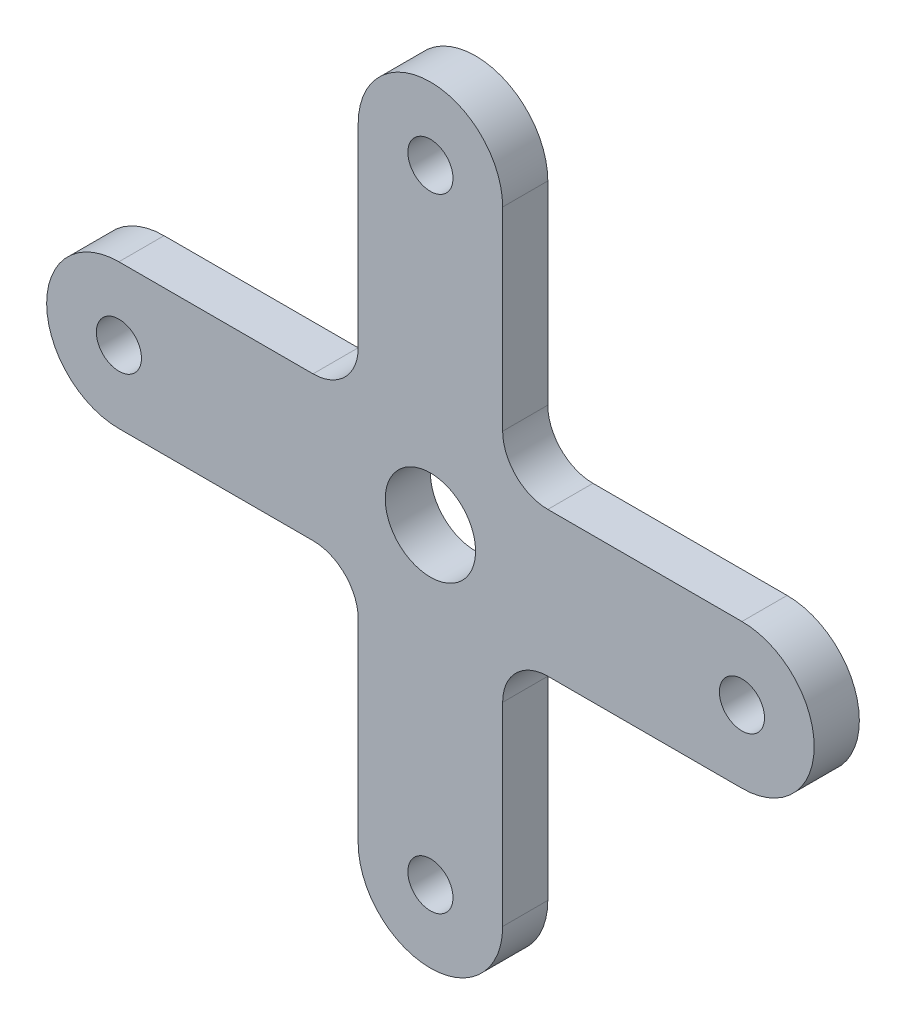
ISO-10303-21;
HEADER;
FILE_DESCRIPTION(('STEP AP214'),'2;1');
FILE_NAME('part.step','',(''),(''),'','','');
FILE_SCHEMA(('AUTOMOTIVE_DESIGN { 1 0 10303 214 1 1 1 1 }'));
ENDSEC;
DATA;
#1=APPLICATION_CONTEXT('core data for automotive mechanical design processes');
#2=APPLICATION_PROTOCOL_DEFINITION('international standard','automotive_design',2000,#1);
#3=PRODUCT_CONTEXT('',#1,'mechanical');
#4=PRODUCT('Part','Part','',(#3));
#5=PRODUCT_RELATED_PRODUCT_CATEGORY('part','',(#4));
#6=PRODUCT_DEFINITION_FORMATION('','',#4);
#7=PRODUCT_DEFINITION_CONTEXT('part definition',#1,'design');
#8=PRODUCT_DEFINITION('design','',#6,#7);
#9=PRODUCT_DEFINITION_SHAPE('','',#8);
#10=(LENGTH_UNIT() NAMED_UNIT(*) SI_UNIT(.MILLI.,.METRE.));
#11=(NAMED_UNIT(*) PLANE_ANGLE_UNIT() SI_UNIT($,.RADIAN.));
#12=(NAMED_UNIT(*) SI_UNIT($,.STERADIAN.) SOLID_ANGLE_UNIT());
#13=UNCERTAINTY_MEASURE_WITH_UNIT(LENGTH_MEASURE(1.E-05),#10,'distance_accuracy_value','');
#14=(GEOMETRIC_REPRESENTATION_CONTEXT(3) GLOBAL_UNCERTAINTY_ASSIGNED_CONTEXT((#13)) GLOBAL_UNIT_ASSIGNED_CONTEXT((#10,
#11,#12)) REPRESENTATION_CONTEXT('',''));
#15=CARTESIAN_POINT('',(0.,0.,0.));
#16=DIRECTION('',(0.,0.,1.));
#17=DIRECTION('',(1.,0.,0.));
#18=AXIS2_PLACEMENT_3D('',#15,#16,#17);
#19=CARTESIAN_POINT('',(-6.9,0.,0.));
#20=DIRECTION('',(0.,0.,1.));
#21=DIRECTION('',(1.,0.,0.));
#22=AXIS2_PLACEMENT_3D('',#19,#20,#21);
#23=PLANE('',#22);
#24=CARTESIAN_POINT('',(0.,-6.9,0.));
#25=DIRECTION('',(0.,0.,-1.));
#26=DIRECTION('',(-1.,0.,0.));
#27=AXIS2_PLACEMENT_3D('',#24,#25,#26);
#28=CIRCLE('',#27,0.500000000000001);
#29=CARTESIAN_POINT('',(-0.500000000000025,-6.9,0.));
#30=VERTEX_POINT('',#29);
#31=EDGE_CURVE('E230',#30,#30,#28,.F.);
#32=ORIENTED_EDGE('',*,*,#31,.T.);
#33=EDGE_LOOP('',(#32));
#34=FACE_BOUND('',#33,.T.);
#35=CARTESIAN_POINT('',(0.,0.,0.));
#36=DIRECTION('',(0.,0.,-1.));
#37=DIRECTION('',(-1.,0.,0.));
#38=AXIS2_PLACEMENT_3D('',#35,#36,#37);
#39=CIRCLE('',#38,1.);
#40=CARTESIAN_POINT('',(-1.,0.,0.));
#41=VERTEX_POINT('',#40);
#42=EDGE_CURVE('E233',#41,#41,#39,.F.);
#43=ORIENTED_EDGE('',*,*,#42,.T.);
#44=EDGE_LOOP('',(#43));
#45=FACE_BOUND('',#44,.T.);
#46=CARTESIAN_POINT('',(-6.9,0.,0.));
#47=DIRECTION('',(0.,0.,-1.));
#48=DIRECTION('',(-1.,0.,0.));
#49=AXIS2_PLACEMENT_3D('',#46,#47,#48);
#50=CIRCLE('',#49,0.5);
#51=CARTESIAN_POINT('',(-7.4,0.,0.));
#52=VERTEX_POINT('',#51);
#53=EDGE_CURVE('E159',#52,#52,#50,.F.);
#54=ORIENTED_EDGE('',*,*,#53,.T.);
#55=EDGE_LOOP('',(#54));
#56=FACE_BOUND('',#55,.T.);
#57=DIRECTION('',(1.,0.,0.));
#58=VECTOR('',#57,1.);
#59=CARTESIAN_POINT('',(-2.59999999999999,1.6,0.));
#60=LINE('',#59,#58);
#61=CARTESIAN_POINT('',(-6.9,1.6,0.));
#62=VERTEX_POINT('',#61);
#63=CARTESIAN_POINT('',(-2.59999999999999,1.6,0.));
#64=VERTEX_POINT('',#63);
#65=EDGE_CURVE('E157',#62,#64,#60,.T.);
#66=ORIENTED_EDGE('',*,*,#65,.T.);
#67=CARTESIAN_POINT('',(-2.59999999999999,2.6,0.));
#68=DIRECTION('',(0.,0.,-1.));
#69=DIRECTION('',(-1.,0.,0.));
#70=AXIS2_PLACEMENT_3D('',#67,#68,#69);
#71=CIRCLE('',#70,1.);
#72=CARTESIAN_POINT('',(-1.59999999999999,2.6,0.));
#73=VERTEX_POINT('',#72);
#74=EDGE_CURVE('E238',#64,#73,#71,.F.);
#75=ORIENTED_EDGE('',*,*,#74,.T.);
#76=DIRECTION('',(0.,1.,0.));
#77=VECTOR('',#76,1.);
#78=CARTESIAN_POINT('',(-1.59999999999998,6.90000000000001,0.));
#79=LINE('',#78,#77);
#80=CARTESIAN_POINT('',(-1.59999999999998,6.90000000000001,0.));
#81=VERTEX_POINT('',#80);
#82=EDGE_CURVE('E160',#73,#81,#79,.T.);
#83=ORIENTED_EDGE('',*,*,#82,.T.);
#84=CARTESIAN_POINT('',(0.,6.9,0.));
#85=DIRECTION('',(0.,0.,-1.));
#86=DIRECTION('',(-1.,0.,0.));
#87=AXIS2_PLACEMENT_3D('',#84,#85,#86);
#88=CIRCLE('',#87,1.6);
#89=CARTESIAN_POINT('',(1.60000000000002,6.9,0.));
#90=VERTEX_POINT('',#89);
#91=EDGE_CURVE('E168',#90,#81,#88,.F.);
#92=ORIENTED_EDGE('',*,*,#91,.F.);
#93=DIRECTION('',(0.,-1.,0.));
#94=VECTOR('',#93,1.);
#95=CARTESIAN_POINT('',(1.60000000000001,2.6,0.));
#96=LINE('',#95,#94);
#97=CARTESIAN_POINT('',(1.60000000000001,2.6,0.));
#98=VERTEX_POINT('',#97);
#99=EDGE_CURVE('E165',#90,#98,#96,.T.);
#100=ORIENTED_EDGE('',*,*,#99,.T.);
#101=CARTESIAN_POINT('',(2.60000000000001,2.6,0.));
#102=DIRECTION('',(0.,0.,-1.));
#103=DIRECTION('',(-1.,0.,0.));
#104=AXIS2_PLACEMENT_3D('',#101,#102,#103);
#105=CIRCLE('',#104,1.);
#106=CARTESIAN_POINT('',(2.60000000000001,1.6,0.));
#107=VERTEX_POINT('',#106);
#108=EDGE_CURVE('E243',#98,#107,#105,.F.);
#109=ORIENTED_EDGE('',*,*,#108,.T.);
#110=DIRECTION('',(1.,0.,0.));
#111=VECTOR('',#110,1.);
#112=CARTESIAN_POINT('',(6.9,1.6,0.));
#113=LINE('',#112,#111);
#114=CARTESIAN_POINT('',(6.9,1.6,0.));
#115=VERTEX_POINT('',#114);
#116=EDGE_CURVE('E170',#107,#115,#113,.T.);
#117=ORIENTED_EDGE('',*,*,#116,.T.);
#118=CARTESIAN_POINT('',(6.9,0.,0.));
#119=DIRECTION('',(0.,0.,-1.));
#120=DIRECTION('',(-1.,0.,0.));
#121=AXIS2_PLACEMENT_3D('',#118,#119,#120);
#122=CIRCLE('',#121,1.6);
#123=CARTESIAN_POINT('',(6.9,-1.6,0.));
#124=VERTEX_POINT('',#123);
#125=EDGE_CURVE('E178',#124,#115,#122,.F.);
#126=ORIENTED_EDGE('',*,*,#125,.F.);
#127=DIRECTION('',(1.,0.,0.));
#128=VECTOR('',#127,1.);
#129=CARTESIAN_POINT('',(2.59999999999999,-1.6,0.));
#130=LINE('',#129,#128);
#131=CARTESIAN_POINT('',(2.59999999999999,-1.6,0.));
#132=VERTEX_POINT('',#131);
#133=EDGE_CURVE('E175',#124,#132,#130,.F.);
#134=ORIENTED_EDGE('',*,*,#133,.T.);
#135=CARTESIAN_POINT('',(2.59999999999999,-2.6,0.));
#136=DIRECTION('',(0.,0.,-1.));
#137=DIRECTION('',(-1.,0.,0.));
#138=AXIS2_PLACEMENT_3D('',#135,#136,#137);
#139=CIRCLE('',#138,1.);
#140=CARTESIAN_POINT('',(1.59999999999999,-2.6,0.));
#141=VERTEX_POINT('',#140);
#142=EDGE_CURVE('E248',#132,#141,#139,.F.);
#143=ORIENTED_EDGE('',*,*,#142,.T.);
#144=DIRECTION('',(0.,-1.,0.));
#145=VECTOR('',#144,1.);
#146=CARTESIAN_POINT('',(1.59999999999998,-6.9,0.));
#147=LINE('',#146,#145);
#148=CARTESIAN_POINT('',(1.59999999999998,-6.9,0.));
#149=VERTEX_POINT('',#148);
#150=EDGE_CURVE('E180',#141,#149,#147,.T.);
#151=ORIENTED_EDGE('',*,*,#150,.T.);
#152=CARTESIAN_POINT('',(0.,-6.9,0.));
#153=DIRECTION('',(0.,0.,-1.));
#154=DIRECTION('',(-1.,0.,0.));
#155=AXIS2_PLACEMENT_3D('',#152,#153,#154);
#156=CIRCLE('',#155,1.6);
#157=CARTESIAN_POINT('',(-1.60000000000002,-6.9,0.));
#158=VERTEX_POINT('',#157);
#159=EDGE_CURVE('E186',#158,#149,#156,.F.);
#160=ORIENTED_EDGE('',*,*,#159,.F.);
#161=DIRECTION('',(0.,1.,0.));
#162=VECTOR('',#161,1.);
#163=CARTESIAN_POINT('',(-1.60000000000001,-2.6,0.));
#164=LINE('',#163,#162);
#165=CARTESIAN_POINT('',(-1.60000000000001,-2.6,0.));
#166=VERTEX_POINT('',#165);
#167=EDGE_CURVE('E185',#158,#166,#164,.T.);
#168=ORIENTED_EDGE('',*,*,#167,.T.);
#169=CARTESIAN_POINT('',(-2.60000000000001,-2.6,0.));
#170=DIRECTION('',(0.,0.,-1.));
#171=DIRECTION('',(-1.,0.,0.));
#172=AXIS2_PLACEMENT_3D('',#169,#170,#171);
#173=CIRCLE('',#172,1.);
#174=CARTESIAN_POINT('',(-2.60000000000001,-1.6,0.));
#175=VERTEX_POINT('',#174);
#176=EDGE_CURVE('E145',#166,#175,#173,.F.);
#177=ORIENTED_EDGE('',*,*,#176,.T.);
#178=DIRECTION('',(1.,0.,0.));
#179=VECTOR('',#178,1.);
#180=CARTESIAN_POINT('',(-6.9,-1.6,0.));
#181=LINE('',#180,#179);
#182=CARTESIAN_POINT('',(-6.9,-1.6,0.));
#183=VERTEX_POINT('',#182);
#184=EDGE_CURVE('E142',#175,#183,#181,.F.);
#185=ORIENTED_EDGE('',*,*,#184,.T.);
#186=CARTESIAN_POINT('',(-6.9,0.,0.));
#187=DIRECTION('',(0.,0.,-1.));
#188=DIRECTION('',(-1.,0.,0.));
#189=AXIS2_PLACEMENT_3D('',#186,#187,#188);
#190=CIRCLE('',#189,1.6);
#191=EDGE_CURVE('E128',#62,#183,#190,.F.);
#192=ORIENTED_EDGE('',*,*,#191,.F.);
#193=EDGE_LOOP('',(#66,#75,#83,#92,#100,#109,#117,#126,#134,#143,#151,#160,#168,#177,#185,#192));
#194=FACE_BOUND('',#193,.T.);
#195=CARTESIAN_POINT('',(6.9,0.,0.));
#196=DIRECTION('',(0.,0.,-1.));
#197=DIRECTION('',(-1.,0.,0.));
#198=AXIS2_PLACEMENT_3D('',#195,#196,#197);
#199=CIRCLE('',#198,0.5);
#200=CARTESIAN_POINT('',(6.4,0.,0.));
#201=VERTEX_POINT('',#200);
#202=EDGE_CURVE('E139',#201,#201,#199,.F.);
#203=ORIENTED_EDGE('',*,*,#202,.T.);
#204=EDGE_LOOP('',(#203));
#205=FACE_BOUND('',#204,.T.);
#206=CARTESIAN_POINT('',(0.,6.9,0.));
#207=DIRECTION('',(0.,0.,-1.));
#208=DIRECTION('',(-1.,0.,0.));
#209=AXIS2_PLACEMENT_3D('',#206,#207,#208);
#210=CIRCLE('',#209,0.500000000000001);
#211=CARTESIAN_POINT('',(-0.499999999999977,6.9,0.));
#212=VERTEX_POINT('',#211);
#213=EDGE_CURVE('E20',#212,#212,#210,.F.);
#214=ORIENTED_EDGE('',*,*,#213,.T.);
#215=EDGE_LOOP('',(#214));
#216=FACE_BOUND('',#215,.T.);
#217=ADVANCED_FACE('F17',(#34,#45,#56,#194,#205,#216),#23,.F.);
#218=CARTESIAN_POINT('',(0.,6.9,1.));
#219=DIRECTION('',(0.,0.,-1.));
#220=DIRECTION('',(-1.,0.,0.));
#221=AXIS2_PLACEMENT_3D('',#218,#219,#220);
#222=CYLINDRICAL_SURFACE('',#221,0.500000000000001);
#223=CARTESIAN_POINT('',(0.,6.9,1.));
#224=DIRECTION('',(0.,0.,-1.));
#225=DIRECTION('',(-1.,0.,0.));
#226=AXIS2_PLACEMENT_3D('',#223,#224,#225);
#227=CIRCLE('',#226,0.500000000000001);
#228=CARTESIAN_POINT('',(-0.499999999999977,6.9,1.));
#229=VERTEX_POINT('',#228);
#230=EDGE_CURVE('E227',#229,#229,#227,.T.);
#231=ORIENTED_EDGE('',*,*,#230,.F.);
#232=EDGE_LOOP('',(#231));
#233=FACE_BOUND('',#232,.T.);
#234=ORIENTED_EDGE('',*,*,#213,.F.);
#235=EDGE_LOOP('',(#234));
#236=FACE_BOUND('',#235,.T.);
#237=ADVANCED_FACE('F259',(#233,#236),#222,.F.);
#238=CARTESIAN_POINT('',(6.9,0.,1.));
#239=DIRECTION('',(0.,0.,-1.));
#240=DIRECTION('',(-1.,0.,0.));
#241=AXIS2_PLACEMENT_3D('',#238,#239,#240);
#242=CYLINDRICAL_SURFACE('',#241,0.5);
#243=CARTESIAN_POINT('',(6.9,0.,1.));
#244=DIRECTION('',(0.,0.,-1.));
#245=DIRECTION('',(-1.,0.,0.));
#246=AXIS2_PLACEMENT_3D('',#243,#244,#245);
#247=CIRCLE('',#246,0.5);
#248=CARTESIAN_POINT('',(6.4,0.,1.));
#249=VERTEX_POINT('',#248);
#250=EDGE_CURVE('E224',#249,#249,#247,.T.);
#251=ORIENTED_EDGE('',*,*,#250,.F.);
#252=EDGE_LOOP('',(#251));
#253=FACE_BOUND('',#252,.T.);
#254=ORIENTED_EDGE('',*,*,#202,.F.);
#255=EDGE_LOOP('',(#254));
#256=FACE_BOUND('',#255,.T.);
#257=ADVANCED_FACE('F261',(#253,#256),#242,.F.);
#258=CARTESIAN_POINT('',(-6.9,0.,1.));
#259=DIRECTION('',(0.,0.,-1.));
#260=DIRECTION('',(-1.,0.,0.));
#261=AXIS2_PLACEMENT_3D('',#258,#259,#260);
#262=CYLINDRICAL_SURFACE('',#261,1.6);
#263=ORIENTED_EDGE('',*,*,#191,.T.);
#264=DIRECTION('',(0.,0.,1.));
#265=VECTOR('',#264,1.);
#266=CARTESIAN_POINT('',(-6.9,-1.6,1.));
#267=LINE('',#266,#265);
#268=CARTESIAN_POINT('',(-6.9,-1.6,1.));
#269=VERTEX_POINT('',#268);
#270=EDGE_CURVE('E132',#183,#269,#267,.T.);
#271=ORIENTED_EDGE('',*,*,#270,.T.);
#272=CARTESIAN_POINT('',(-6.9,0.,1.));
#273=DIRECTION('',(0.,0.,-1.));
#274=DIRECTION('',(-1.,0.,0.));
#275=AXIS2_PLACEMENT_3D('',#272,#273,#274);
#276=CIRCLE('',#275,1.6);
#277=CARTESIAN_POINT('',(-6.9,1.6,1.));
#278=VERTEX_POINT('',#277);
#279=EDGE_CURVE('E222',#278,#269,#276,.F.);
#280=ORIENTED_EDGE('',*,*,#279,.F.);
#281=DIRECTION('',(0.,0.,1.));
#282=VECTOR('',#281,1.);
#283=CARTESIAN_POINT('',(-6.9,1.6,1.));
#284=LINE('',#283,#282);
#285=EDGE_CURVE('E135',#278,#62,#284,.F.);
#286=ORIENTED_EDGE('',*,*,#285,.T.);
#287=EDGE_LOOP('',(#263,#271,#280,#286));
#288=FACE_BOUND('',#287,.T.);
#289=ADVANCED_FACE('F130',(#288),#262,.T.);
#290=CARTESIAN_POINT('',(-6.9,-1.6,1.));
#291=DIRECTION('',(0.,1.,0.));
#292=DIRECTION('',(0.,0.,1.));
#293=AXIS2_PLACEMENT_3D('',#290,#291,#292);
#294=PLANE('',#293);
#295=DIRECTION('',(0.,0.,-1.));
#296=VECTOR('',#295,1.);
#297=CARTESIAN_POINT('',(-2.60000000000001,-1.6,1.));
#298=LINE('',#297,#296);
#299=CARTESIAN_POINT('',(-2.60000000000001,-1.6,1.));
#300=VERTEX_POINT('',#299);
#301=EDGE_CURVE('E148',#175,#300,#298,.F.);
#302=ORIENTED_EDGE('',*,*,#301,.T.);
#303=DIRECTION('',(1.,0.,0.));
#304=VECTOR('',#303,1.);
#305=CARTESIAN_POINT('',(-6.9,-1.6,1.));
#306=LINE('',#305,#304);
#307=EDGE_CURVE('E152',#269,#300,#306,.T.);
#308=ORIENTED_EDGE('',*,*,#307,.F.);
#309=ORIENTED_EDGE('',*,*,#270,.F.);
#310=ORIENTED_EDGE('',*,*,#184,.F.);
#311=EDGE_LOOP('',(#302,#308,#309,#310));
#312=FACE_BOUND('',#311,.T.);
#313=ADVANCED_FACE('F150',(#312),#294,.F.);
#314=CARTESIAN_POINT('',(-2.60000000000001,-2.6,1.));
#315=DIRECTION('',(0.,0.,-1.));
#316=DIRECTION('',(-1.,0.,0.));
#317=AXIS2_PLACEMENT_3D('',#314,#315,#316);
#318=CYLINDRICAL_SURFACE('',#317,1.);
#319=DIRECTION('',(0.,0.,1.));
#320=VECTOR('',#319,1.);
#321=CARTESIAN_POINT('',(-1.60000000000001,-2.6,1.));
#322=LINE('',#321,#320);
#323=CARTESIAN_POINT('',(-1.60000000000001,-2.6,1.));
#324=VERTEX_POINT('',#323);
#325=EDGE_CURVE('E187',#166,#324,#322,.T.);
#326=ORIENTED_EDGE('',*,*,#325,.T.);
#327=CARTESIAN_POINT('',(-2.60000000000001,-2.6,1.));
#328=DIRECTION('',(0.,0.,-1.));
#329=DIRECTION('',(-1.,0.,0.));
#330=AXIS2_PLACEMENT_3D('',#327,#328,#329);
#331=CIRCLE('',#330,1.);
#332=EDGE_CURVE('E219',#300,#324,#331,.T.);
#333=ORIENTED_EDGE('',*,*,#332,.F.);
#334=ORIENTED_EDGE('',*,*,#301,.F.);
#335=ORIENTED_EDGE('',*,*,#176,.F.);
#336=EDGE_LOOP('',(#326,#333,#334,#335));
#337=FACE_BOUND('',#336,.T.);
#338=ADVANCED_FACE('F342',(#337),#318,.F.);
#339=CARTESIAN_POINT('',(-1.60000000000001,-2.6,1.));
#340=DIRECTION('',(1.,0.,0.));
#341=DIRECTION('',(0.,1.,0.));
#342=AXIS2_PLACEMENT_3D('',#339,#340,#341);
#343=PLANE('',#342);
#344=DIRECTION('',(0.,0.,-1.));
#345=VECTOR('',#344,1.);
#346=CARTESIAN_POINT('',(-1.60000000000002,-6.9,1.));
#347=LINE('',#346,#345);
#348=CARTESIAN_POINT('',(-1.60000000000002,-6.9,1.));
#349=VERTEX_POINT('',#348);
#350=EDGE_CURVE('E252',#349,#158,#347,.T.);
#351=ORIENTED_EDGE('',*,*,#350,.F.);
#352=DIRECTION('',(0.,1.,0.));
#353=VECTOR('',#352,1.);
#354=CARTESIAN_POINT('',(-1.60000000000001,0.,1.));
#355=LINE('',#354,#353);
#356=EDGE_CURVE('E218',#324,#349,#355,.F.);
#357=ORIENTED_EDGE('',*,*,#356,.F.);
#358=ORIENTED_EDGE('',*,*,#325,.F.);
#359=ORIENTED_EDGE('',*,*,#167,.F.);
#360=EDGE_LOOP('',(#351,#357,#358,#359));
#361=FACE_BOUND('',#360,.T.);
#362=ADVANCED_FACE('F338',(#361),#343,.F.);
#363=CARTESIAN_POINT('',(0.,-6.9,1.));
#364=DIRECTION('',(0.,0.,-1.));
#365=DIRECTION('',(-1.,0.,0.));
#366=AXIS2_PLACEMENT_3D('',#363,#364,#365);
#367=CYLINDRICAL_SURFACE('',#366,1.6);
#368=CARTESIAN_POINT('',(0.,-6.9,1.));
#369=DIRECTION('',(0.,0.,-1.));
#370=DIRECTION('',(-1.,0.,0.));
#371=AXIS2_PLACEMENT_3D('',#368,#369,#370);
#372=CIRCLE('',#371,1.6);
#373=CARTESIAN_POINT('',(1.59999999999998,-6.9,1.));
#374=VERTEX_POINT('',#373);
#375=EDGE_CURVE('E215',#349,#374,#372,.F.);
#376=ORIENTED_EDGE('',*,*,#375,.F.);
#377=ORIENTED_EDGE('',*,*,#350,.T.);
#378=ORIENTED_EDGE('',*,*,#159,.T.);
#379=DIRECTION('',(0.,0.,1.));
#380=VECTOR('',#379,1.);
#381=CARTESIAN_POINT('',(1.59999999999998,-6.9,1.));
#382=LINE('',#381,#380);
#383=EDGE_CURVE('E184',#149,#374,#382,.T.);
#384=ORIENTED_EDGE('',*,*,#383,.T.);
#385=EDGE_LOOP('',(#376,#377,#378,#384));
#386=FACE_BOUND('',#385,.T.);
#387=ADVANCED_FACE('F334',(#386),#367,.T.);
#388=CARTESIAN_POINT('',(1.59999999999998,-6.9,1.));
#389=DIRECTION('',(-1.,0.,0.));
#390=DIRECTION('',(0.,-1.,0.));
#391=AXIS2_PLACEMENT_3D('',#388,#389,#390);
#392=PLANE('',#391);
#393=DIRECTION('',(0.,0.,-1.));
#394=VECTOR('',#393,1.);
#395=CARTESIAN_POINT('',(1.59999999999999,-2.6,1.));
#396=LINE('',#395,#394);
#397=CARTESIAN_POINT('',(1.59999999999998,-2.6,1.));
#398=VERTEX_POINT('',#397);
#399=EDGE_CURVE('E183',#141,#398,#396,.F.);
#400=ORIENTED_EDGE('',*,*,#399,.T.);
#401=DIRECTION('',(0.,1.,0.));
#402=VECTOR('',#401,1.);
#403=CARTESIAN_POINT('',(1.59999999999998,0.,1.));
#404=LINE('',#403,#402);
#405=EDGE_CURVE('E214',#374,#398,#404,.T.);
#406=ORIENTED_EDGE('',*,*,#405,.F.);
#407=ORIENTED_EDGE('',*,*,#383,.F.);
#408=ORIENTED_EDGE('',*,*,#150,.F.);
#409=EDGE_LOOP('',(#400,#406,#407,#408));
#410=FACE_BOUND('',#409,.T.);
#411=ADVANCED_FACE('F330',(#410),#392,.F.);
#412=CARTESIAN_POINT('',(2.59999999999999,-2.6,1.));
#413=DIRECTION('',(0.,0.,-1.));
#414=DIRECTION('',(-1.,0.,0.));
#415=AXIS2_PLACEMENT_3D('',#412,#413,#414);
#416=CYLINDRICAL_SURFACE('',#415,1.);
#417=DIRECTION('',(0.,0.,1.));
#418=VECTOR('',#417,1.);
#419=CARTESIAN_POINT('',(2.59999999999999,-1.6,1.));
#420=LINE('',#419,#418);
#421=CARTESIAN_POINT('',(2.59999999999999,-1.6,1.));
#422=VERTEX_POINT('',#421);
#423=EDGE_CURVE('E179',#132,#422,#420,.T.);
#424=ORIENTED_EDGE('',*,*,#423,.T.);
#425=CARTESIAN_POINT('',(2.59999999999999,-2.6,1.));
#426=DIRECTION('',(0.,0.,-1.));
#427=DIRECTION('',(-1.,0.,0.));
#428=AXIS2_PLACEMENT_3D('',#425,#426,#427);
#429=CIRCLE('',#428,1.);
#430=EDGE_CURVE('E211',#398,#422,#429,.T.);
#431=ORIENTED_EDGE('',*,*,#430,.F.);
#432=ORIENTED_EDGE('',*,*,#399,.F.);
#433=ORIENTED_EDGE('',*,*,#142,.F.);
#434=EDGE_LOOP('',(#424,#431,#432,#433));
#435=FACE_BOUND('',#434,.T.);
#436=ADVANCED_FACE('F326',(#435),#416,.F.);
#437=CARTESIAN_POINT('',(2.59999999999999,-1.6,1.));
#438=DIRECTION('',(0.,1.,0.));
#439=DIRECTION('',(0.,0.,1.));
#440=AXIS2_PLACEMENT_3D('',#437,#438,#439);
#441=PLANE('',#440);
#442=DIRECTION('',(0.,0.,-1.));
#443=VECTOR('',#442,1.);
#444=CARTESIAN_POINT('',(6.9,-1.6,1.));
#445=LINE('',#444,#443);
#446=CARTESIAN_POINT('',(6.9,-1.6,1.));
#447=VERTEX_POINT('',#446);
#448=EDGE_CURVE('E247',#447,#124,#445,.T.);
#449=ORIENTED_EDGE('',*,*,#448,.F.);
#450=DIRECTION('',(1.,0.,0.));
#451=VECTOR('',#450,1.);
#452=CARTESIAN_POINT('',(-6.9,-1.6,1.));
#453=LINE('',#452,#451);
#454=EDGE_CURVE('E210',#422,#447,#453,.T.);
#455=ORIENTED_EDGE('',*,*,#454,.F.);
#456=ORIENTED_EDGE('',*,*,#423,.F.);
#457=ORIENTED_EDGE('',*,*,#133,.F.);
#458=EDGE_LOOP('',(#449,#455,#456,#457));
#459=FACE_BOUND('',#458,.T.);
#460=ADVANCED_FACE('F322',(#459),#441,.F.);
#461=CARTESIAN_POINT('',(6.9,0.,1.));
#462=DIRECTION('',(0.,0.,-1.));
#463=DIRECTION('',(-1.,0.,0.));
#464=AXIS2_PLACEMENT_3D('',#461,#462,#463);
#465=CYLINDRICAL_SURFACE('',#464,1.6);
#466=CARTESIAN_POINT('',(6.9,0.,1.));
#467=DIRECTION('',(0.,0.,-1.));
#468=DIRECTION('',(-1.,0.,0.));
#469=AXIS2_PLACEMENT_3D('',#466,#467,#468);
#470=CIRCLE('',#469,1.6);
#471=CARTESIAN_POINT('',(6.9,1.6,1.));
#472=VERTEX_POINT('',#471);
#473=EDGE_CURVE('E207',#447,#472,#470,.F.);
#474=ORIENTED_EDGE('',*,*,#473,.F.);
#475=ORIENTED_EDGE('',*,*,#448,.T.);
#476=ORIENTED_EDGE('',*,*,#125,.T.);
#477=DIRECTION('',(0.,0.,1.));
#478=VECTOR('',#477,1.);
#479=CARTESIAN_POINT('',(6.9,1.6,1.));
#480=LINE('',#479,#478);
#481=EDGE_CURVE('E174',#115,#472,#480,.T.);
#482=ORIENTED_EDGE('',*,*,#481,.T.);
#483=EDGE_LOOP('',(#474,#475,#476,#482));
#484=FACE_BOUND('',#483,.T.);
#485=ADVANCED_FACE('F318',(#484),#465,.T.);
#486=CARTESIAN_POINT('',(6.9,1.6,1.));
#487=DIRECTION('',(0.,-1.,0.));
#488=DIRECTION('',(1.,0.,0.));
#489=AXIS2_PLACEMENT_3D('',#486,#487,#488);
#490=PLANE('',#489);
#491=DIRECTION('',(0.,0.,-1.));
#492=VECTOR('',#491,1.);
#493=CARTESIAN_POINT('',(2.60000000000001,1.6,1.));
#494=LINE('',#493,#492);
#495=CARTESIAN_POINT('',(2.60000000000001,1.6,1.));
#496=VERTEX_POINT('',#495);
#497=EDGE_CURVE('E173',#107,#496,#494,.F.);
#498=ORIENTED_EDGE('',*,*,#497,.T.);
#499=DIRECTION('',(1.,0.,0.));
#500=VECTOR('',#499,1.);
#501=CARTESIAN_POINT('',(-6.9,1.6,1.));
#502=LINE('',#501,#500);
#503=EDGE_CURVE('E206',#472,#496,#502,.F.);
#504=ORIENTED_EDGE('',*,*,#503,.F.);
#505=ORIENTED_EDGE('',*,*,#481,.F.);
#506=ORIENTED_EDGE('',*,*,#116,.F.);
#507=EDGE_LOOP('',(#498,#504,#505,#506));
#508=FACE_BOUND('',#507,.T.);
#509=ADVANCED_FACE('F314',(#508),#490,.F.);
#510=CARTESIAN_POINT('',(2.60000000000001,2.6,1.));
#511=DIRECTION('',(0.,0.,-1.));
#512=DIRECTION('',(-1.,0.,0.));
#513=AXIS2_PLACEMENT_3D('',#510,#511,#512);
#514=CYLINDRICAL_SURFACE('',#513,1.);
#515=DIRECTION('',(0.,0.,1.));
#516=VECTOR('',#515,1.);
#517=CARTESIAN_POINT('',(1.60000000000001,2.6,1.));
#518=LINE('',#517,#516);
#519=CARTESIAN_POINT('',(1.60000000000001,2.6,1.));
#520=VERTEX_POINT('',#519);
#521=EDGE_CURVE('E169',#98,#520,#518,.T.);
#522=ORIENTED_EDGE('',*,*,#521,.T.);
#523=CARTESIAN_POINT('',(2.60000000000001,2.6,1.));
#524=DIRECTION('',(0.,0.,-1.));
#525=DIRECTION('',(-1.,0.,0.));
#526=AXIS2_PLACEMENT_3D('',#523,#524,#525);
#527=CIRCLE('',#526,1.);
#528=EDGE_CURVE('E203',#496,#520,#527,.T.);
#529=ORIENTED_EDGE('',*,*,#528,.F.);
#530=ORIENTED_EDGE('',*,*,#497,.F.);
#531=ORIENTED_EDGE('',*,*,#108,.F.);
#532=EDGE_LOOP('',(#522,#529,#530,#531));
#533=FACE_BOUND('',#532,.T.);
#534=ADVANCED_FACE('F310',(#533),#514,.F.);
#535=CARTESIAN_POINT('',(1.60000000000001,2.6,1.));
#536=DIRECTION('',(-1.,0.,0.));
#537=DIRECTION('',(0.,-1.,0.));
#538=AXIS2_PLACEMENT_3D('',#535,#536,#537);
#539=PLANE('',#538);
#540=DIRECTION('',(0.,0.,-1.));
#541=VECTOR('',#540,1.);
#542=CARTESIAN_POINT('',(1.60000000000002,6.9,1.));
#543=LINE('',#542,#541);
#544=CARTESIAN_POINT('',(1.60000000000002,6.9,1.));
#545=VERTEX_POINT('',#544);
#546=EDGE_CURVE('E242',#545,#90,#543,.T.);
#547=ORIENTED_EDGE('',*,*,#546,.F.);
#548=DIRECTION('',(0.,1.,0.));
#549=VECTOR('',#548,1.);
#550=CARTESIAN_POINT('',(1.60000000000001,0.,1.));
#551=LINE('',#550,#549);
#552=EDGE_CURVE('E202',#520,#545,#551,.T.);
#553=ORIENTED_EDGE('',*,*,#552,.F.);
#554=ORIENTED_EDGE('',*,*,#521,.F.);
#555=ORIENTED_EDGE('',*,*,#99,.F.);
#556=EDGE_LOOP('',(#547,#553,#554,#555));
#557=FACE_BOUND('',#556,.T.);
#558=ADVANCED_FACE('F306',(#557),#539,.F.);
#559=CARTESIAN_POINT('',(0.,6.9,1.));
#560=DIRECTION('',(0.,0.,-1.));
#561=DIRECTION('',(-1.,0.,0.));
#562=AXIS2_PLACEMENT_3D('',#559,#560,#561);
#563=CYLINDRICAL_SURFACE('',#562,1.6);
#564=CARTESIAN_POINT('',(0.,6.9,1.));
#565=DIRECTION('',(0.,0.,-1.));
#566=DIRECTION('',(-1.,0.,0.));
#567=AXIS2_PLACEMENT_3D('',#564,#565,#566);
#568=CIRCLE('',#567,1.6);
#569=CARTESIAN_POINT('',(-1.59999999999998,6.9,1.));
#570=VERTEX_POINT('',#569);
#571=EDGE_CURVE('E199',#545,#570,#568,.F.);
#572=ORIENTED_EDGE('',*,*,#571,.F.);
#573=ORIENTED_EDGE('',*,*,#546,.T.);
#574=ORIENTED_EDGE('',*,*,#91,.T.);
#575=DIRECTION('',(0.,0.,1.));
#576=VECTOR('',#575,1.);
#577=CARTESIAN_POINT('',(-1.59999999999998,6.90000000000001,1.));
#578=LINE('',#577,#576);
#579=EDGE_CURVE('E164',#81,#570,#578,.T.);
#580=ORIENTED_EDGE('',*,*,#579,.T.);
#581=EDGE_LOOP('',(#572,#573,#574,#580));
#582=FACE_BOUND('',#581,.T.);
#583=ADVANCED_FACE('F302',(#582),#563,.T.);
#584=CARTESIAN_POINT('',(-1.59999999999998,6.90000000000001,1.));
#585=DIRECTION('',(1.,0.,0.));
#586=DIRECTION('',(0.,1.,0.));
#587=AXIS2_PLACEMENT_3D('',#584,#585,#586);
#588=PLANE('',#587);
#589=DIRECTION('',(0.,0.,-1.));
#590=VECTOR('',#589,1.);
#591=CARTESIAN_POINT('',(-1.59999999999999,2.6,1.));
#592=LINE('',#591,#590);
#593=CARTESIAN_POINT('',(-1.59999999999998,2.6,1.));
#594=VERTEX_POINT('',#593);
#595=EDGE_CURVE('E163',#73,#594,#592,.F.);
#596=ORIENTED_EDGE('',*,*,#595,.T.);
#597=DIRECTION('',(0.,1.,0.));
#598=VECTOR('',#597,1.);
#599=CARTESIAN_POINT('',(-1.59999999999998,0.,1.));
#600=LINE('',#599,#598);
#601=EDGE_CURVE('E198',#570,#594,#600,.F.);
#602=ORIENTED_EDGE('',*,*,#601,.F.);
#603=ORIENTED_EDGE('',*,*,#579,.F.);
#604=ORIENTED_EDGE('',*,*,#82,.F.);
#605=EDGE_LOOP('',(#596,#602,#603,#604));
#606=FACE_BOUND('',#605,.T.);
#607=ADVANCED_FACE('F299',(#606),#588,.F.);
#608=CARTESIAN_POINT('',(-2.59999999999999,2.6,1.));
#609=DIRECTION('',(0.,0.,-1.));
#610=DIRECTION('',(-1.,0.,0.));
#611=AXIS2_PLACEMENT_3D('',#608,#609,#610);
#612=CYLINDRICAL_SURFACE('',#611,1.);
#613=DIRECTION('',(0.,0.,1.));
#614=VECTOR('',#613,1.);
#615=CARTESIAN_POINT('',(-2.59999999999999,1.6,1.));
#616=LINE('',#615,#614);
#617=CARTESIAN_POINT('',(-2.59999999999999,1.6,1.));
#618=VERTEX_POINT('',#617);
#619=EDGE_CURVE('E35',#64,#618,#616,.T.);
#620=ORIENTED_EDGE('',*,*,#619,.T.);
#621=CARTESIAN_POINT('',(-2.59999999999999,2.6,1.));
#622=DIRECTION('',(0.,0.,-1.));
#623=DIRECTION('',(-1.,0.,0.));
#624=AXIS2_PLACEMENT_3D('',#621,#622,#623);
#625=CIRCLE('',#624,1.);
#626=EDGE_CURVE('E195',#594,#618,#625,.T.);
#627=ORIENTED_EDGE('',*,*,#626,.F.);
#628=ORIENTED_EDGE('',*,*,#595,.F.);
#629=ORIENTED_EDGE('',*,*,#74,.F.);
#630=EDGE_LOOP('',(#620,#627,#628,#629));
#631=FACE_BOUND('',#630,.T.);
#632=ADVANCED_FACE('F295',(#631),#612,.F.);
#633=CARTESIAN_POINT('',(-2.59999999999999,1.6,1.));
#634=DIRECTION('',(0.,-1.,0.));
#635=DIRECTION('',(1.,0.,0.));
#636=AXIS2_PLACEMENT_3D('',#633,#634,#635);
#637=PLANE('',#636);
#638=ORIENTED_EDGE('',*,*,#285,.F.);
#639=DIRECTION('',(1.,0.,0.));
#640=VECTOR('',#639,1.);
#641=CARTESIAN_POINT('',(-6.9,1.6,1.));
#642=LINE('',#641,#640);
#643=EDGE_CURVE('E194',#618,#278,#642,.F.);
#644=ORIENTED_EDGE('',*,*,#643,.F.);
#645=ORIENTED_EDGE('',*,*,#619,.F.);
#646=ORIENTED_EDGE('',*,*,#65,.F.);
#647=EDGE_LOOP('',(#638,#644,#645,#646));
#648=FACE_BOUND('',#647,.T.);
#649=ADVANCED_FACE('F291',(#648),#637,.F.);
#650=CARTESIAN_POINT('',(-6.9,0.,1.));
#651=DIRECTION('',(0.,0.,-1.));
#652=DIRECTION('',(-1.,0.,0.));
#653=AXIS2_PLACEMENT_3D('',#650,#651,#652);
#654=CYLINDRICAL_SURFACE('',#653,0.5);
#655=CARTESIAN_POINT('',(-6.9,0.,1.));
#656=DIRECTION('',(0.,0.,-1.));
#657=DIRECTION('',(-1.,0.,0.));
#658=AXIS2_PLACEMENT_3D('',#655,#656,#657);
#659=CIRCLE('',#658,0.5);
#660=CARTESIAN_POINT('',(-7.4,0.,1.));
#661=VERTEX_POINT('',#660);
#662=EDGE_CURVE('E191',#661,#661,#659,.T.);
#663=ORIENTED_EDGE('',*,*,#662,.F.);
#664=EDGE_LOOP('',(#663));
#665=FACE_BOUND('',#664,.T.);
#666=ORIENTED_EDGE('',*,*,#53,.F.);
#667=EDGE_LOOP('',(#666));
#668=FACE_BOUND('',#667,.T.);
#669=ADVANCED_FACE('F287',(#665,#668),#654,.F.);
#670=CARTESIAN_POINT('',(0.,0.,1.));
#671=DIRECTION('',(0.,0.,-1.));
#672=DIRECTION('',(-1.,0.,0.));
#673=AXIS2_PLACEMENT_3D('',#670,#671,#672);
#674=CYLINDRICAL_SURFACE('',#673,1.);
#675=CARTESIAN_POINT('',(0.,0.,1.));
#676=DIRECTION('',(0.,0.,-1.));
#677=DIRECTION('',(-1.,0.,0.));
#678=AXIS2_PLACEMENT_3D('',#675,#676,#677);
#679=CIRCLE('',#678,1.);
#680=CARTESIAN_POINT('',(-1.,0.,1.));
#681=VERTEX_POINT('',#680);
#682=EDGE_CURVE('E26',#681,#681,#679,.T.);
#683=ORIENTED_EDGE('',*,*,#682,.F.);
#684=EDGE_LOOP('',(#683));
#685=FACE_BOUND('',#684,.T.);
#686=ORIENTED_EDGE('',*,*,#42,.F.);
#687=EDGE_LOOP('',(#686));
#688=FACE_BOUND('',#687,.T.);
#689=ADVANCED_FACE('F280',(#685,#688),#674,.F.);
#690=CARTESIAN_POINT('',(0.,-6.9,1.));
#691=DIRECTION('',(0.,0.,-1.));
#692=DIRECTION('',(-1.,0.,0.));
#693=AXIS2_PLACEMENT_3D('',#690,#691,#692);
#694=CYLINDRICAL_SURFACE('',#693,0.500000000000001);
#695=CARTESIAN_POINT('',(0.,-6.9,1.));
#696=DIRECTION('',(0.,0.,-1.));
#697=DIRECTION('',(-1.,0.,0.));
#698=AXIS2_PLACEMENT_3D('',#695,#696,#697);
#699=CIRCLE('',#698,0.500000000000001);
#700=CARTESIAN_POINT('',(-0.500000000000025,-6.9,1.));
#701=VERTEX_POINT('',#700);
#702=EDGE_CURVE('E11',#701,#701,#699,.T.);
#703=ORIENTED_EDGE('',*,*,#702,.F.);
#704=EDGE_LOOP('',(#703));
#705=FACE_BOUND('',#704,.T.);
#706=ORIENTED_EDGE('',*,*,#31,.F.);
#707=EDGE_LOOP('',(#706));
#708=FACE_BOUND('',#707,.T.);
#709=ADVANCED_FACE('F274',(#705,#708),#694,.F.);
#710=CARTESIAN_POINT('',(-6.9,0.,1.));
#711=DIRECTION('',(0.,0.,1.));
#712=DIRECTION('',(1.,0.,0.));
#713=AXIS2_PLACEMENT_3D('',#710,#711,#712);
#714=PLANE('',#713);
#715=ORIENTED_EDGE('',*,*,#702,.T.);
#716=EDGE_LOOP('',(#715));
#717=FACE_BOUND('',#716,.T.);
#718=ORIENTED_EDGE('',*,*,#682,.T.);
#719=EDGE_LOOP('',(#718));
#720=FACE_BOUND('',#719,.T.);
#721=ORIENTED_EDGE('',*,*,#662,.T.);
#722=EDGE_LOOP('',(#721));
#723=FACE_BOUND('',#722,.T.);
#724=ORIENTED_EDGE('',*,*,#626,.T.);
#725=ORIENTED_EDGE('',*,*,#643,.T.);
#726=ORIENTED_EDGE('',*,*,#279,.T.);
#727=ORIENTED_EDGE('',*,*,#307,.T.);
#728=ORIENTED_EDGE('',*,*,#332,.T.);
#729=ORIENTED_EDGE('',*,*,#356,.T.);
#730=ORIENTED_EDGE('',*,*,#375,.T.);
#731=ORIENTED_EDGE('',*,*,#405,.T.);
#732=ORIENTED_EDGE('',*,*,#430,.T.);
#733=ORIENTED_EDGE('',*,*,#454,.T.);
#734=ORIENTED_EDGE('',*,*,#473,.T.);
#735=ORIENTED_EDGE('',*,*,#503,.T.);
#736=ORIENTED_EDGE('',*,*,#528,.T.);
#737=ORIENTED_EDGE('',*,*,#552,.T.);
#738=ORIENTED_EDGE('',*,*,#571,.T.);
#739=ORIENTED_EDGE('',*,*,#601,.T.);
#740=EDGE_LOOP('',(#724,#725,#726,#727,#728,#729,#730,#731,#732,#733,#734,#735,#736,#737,#738,#739));
#741=FACE_BOUND('',#740,.T.);
#742=ORIENTED_EDGE('',*,*,#250,.T.);
#743=EDGE_LOOP('',(#742));
#744=FACE_BOUND('',#743,.T.);
#745=ORIENTED_EDGE('',*,*,#230,.T.);
#746=EDGE_LOOP('',(#745));
#747=FACE_BOUND('',#746,.T.);
#748=ADVANCED_FACE('F272',(#717,#720,#723,#741,#744,#747),#714,.T.);
#749=CLOSED_SHELL('',(#217,#237,#257,#289,#313,#338,#362,#387,#411,#436,#460,#485,#509,#534,
#558,#583,#607,#632,#649,#669,#689,#709,#748));
#750=MANIFOLD_SOLID_BREP('B1',#749);
#751=ADVANCED_BREP_SHAPE_REPRESENTATION('',(#18,#750),#14);
#752=SHAPE_DEFINITION_REPRESENTATION(#9,#751);
ENDSEC;
END-ISO-10303-21;
